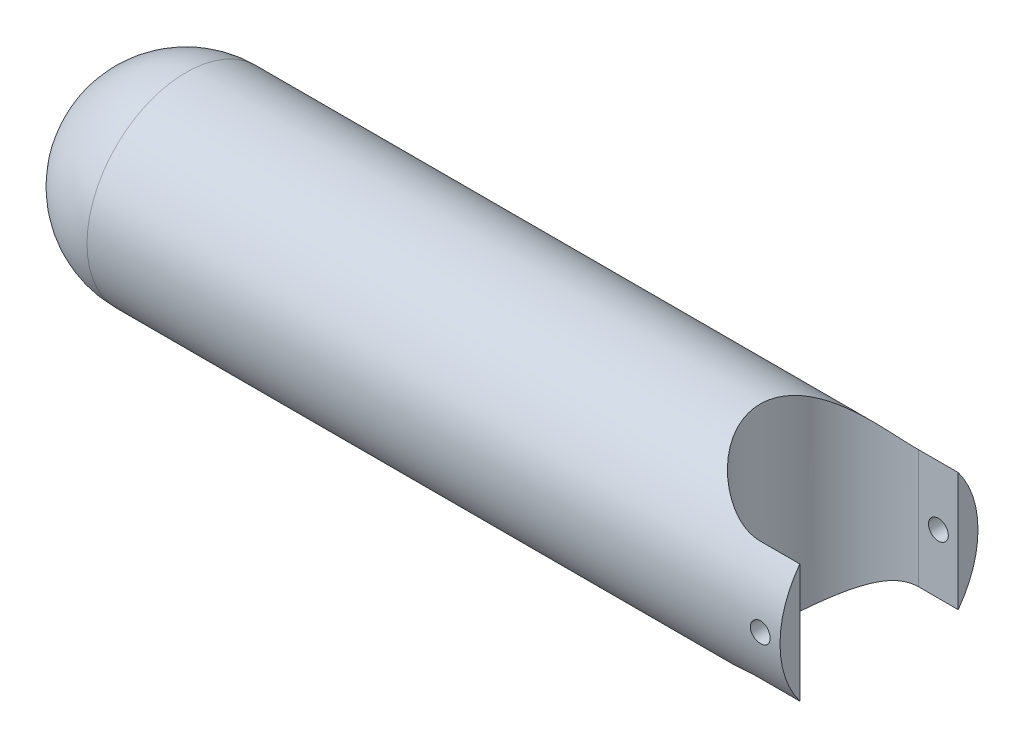
ISO-10303-21;
HEADER;
FILE_DESCRIPTION(('STEP AP214'),'2;1');
FILE_NAME('part.step','',(''),(''),'','','');
FILE_SCHEMA(('AUTOMOTIVE_DESIGN { 1 0 10303 214 1 1 1 1 }'));
ENDSEC;
DATA;
#1=APPLICATION_CONTEXT('core data for automotive mechanical design processes');
#2=APPLICATION_PROTOCOL_DEFINITION('international standard','automotive_design',2000,#1);
#3=PRODUCT_CONTEXT('',#1,'mechanical');
#4=PRODUCT('Part','Part','',(#3));
#5=PRODUCT_RELATED_PRODUCT_CATEGORY('part','',(#4));
#6=PRODUCT_DEFINITION_FORMATION('','',#4);
#7=PRODUCT_DEFINITION_CONTEXT('part definition',#1,'design');
#8=PRODUCT_DEFINITION('design','',#6,#7);
#9=PRODUCT_DEFINITION_SHAPE('','',#8);
#10=(LENGTH_UNIT() NAMED_UNIT(*) SI_UNIT(.MILLI.,.METRE.));
#11=(NAMED_UNIT(*) PLANE_ANGLE_UNIT() SI_UNIT($,.RADIAN.));
#12=(NAMED_UNIT(*) SI_UNIT($,.STERADIAN.) SOLID_ANGLE_UNIT());
#13=UNCERTAINTY_MEASURE_WITH_UNIT(LENGTH_MEASURE(1.E-05),#10,'distance_accuracy_value','');
#14=(GEOMETRIC_REPRESENTATION_CONTEXT(3) GLOBAL_UNCERTAINTY_ASSIGNED_CONTEXT((#13)) GLOBAL_UNIT_ASSIGNED_CONTEXT((#10,
#11,#12)) REPRESENTATION_CONTEXT('',''));
#15=CARTESIAN_POINT('',(0.,0.,0.));
#16=DIRECTION('',(0.,0.,1.));
#17=DIRECTION('',(1.,0.,0.));
#18=AXIS2_PLACEMENT_3D('',#15,#16,#17);
#19=CARTESIAN_POINT('',(-38.0819921267837,0.,0.));
#20=DIRECTION('',(-1.,0.,0.));
#21=DIRECTION('',(0.,0.,1.));
#22=AXIS2_PLACEMENT_3D('',#19,#20,#21);
#23=CYLINDRICAL_SURFACE('',#22,25.);
#24=CARTESIAN_POINT('',(159.418007873216,0.,-25.));
#25=CARTESIAN_POINT('',(159.418001808465,0.140050884478916,-24.9999983880193));
#26=CARTESIAN_POINT('',(159.406199700975,0.280194362919456,-24.9988106399052));
#27=CARTESIAN_POINT('',(159.35929694749,0.556595996242115,-24.9941866898685));
#28=CARTESIAN_POINT('',(159.324170633155,0.692849697922092,-24.9907480108507));
#29=CARTESIAN_POINT('',(159.231652271722,0.957429188633559,-24.9820103640768));
#30=CARTESIAN_POINT('',(159.17427367192,1.0857597115373,-24.9767125200177));
#31=CARTESIAN_POINT('',(159.038905603387,1.33094040240104,-24.9648489348577));
#32=CARTESIAN_POINT('',(158.960920233216,1.44779284694772,-24.9582834459533));
#33=CARTESIAN_POINT('',(158.786251129061,1.66714887668523,-24.9445936085331));
#34=CARTESIAN_POINT('',(158.689508374711,1.76960536208726,-24.9374675393467));
#35=CARTESIAN_POINT('',(158.480196537559,1.95685630357749,-24.9234739226566));
#36=CARTESIAN_POINT('',(158.36762672311,2.04164994270666,-24.9166063871229));
#37=CARTESIAN_POINT('',(158.129561544007,2.19133492610906,-24.9038897888196));
#38=CARTESIAN_POINT('',(158.004039262979,2.25618366363722,-24.8980429177726));
#39=CARTESIAN_POINT('',(157.743818908454,2.36386596185692,-24.8880509386631));
#40=CARTESIAN_POINT('',(157.609121061756,2.40670006647825,-24.8839057885556));
#41=CARTESIAN_POINT('',(157.334853371051,2.46899760400475,-24.8778021018245));
#42=CARTESIAN_POINT('',(157.195301431086,2.48853913250951,-24.8758362599524));
#43=CARTESIAN_POINT('',(156.914885714727,2.50393821283842,-24.8742910765132));
#44=CARTESIAN_POINT('',(156.774021972911,2.49979638717702,-24.8747116722187));
#45=CARTESIAN_POINT('',(156.495519598983,2.46801070063171,-24.8778851724734));
#46=CARTESIAN_POINT('',(156.357871124895,2.44045211031139,-24.8806296147663));
#47=CARTESIAN_POINT('',(156.089162965214,2.36274786037649,-24.8881283571855));
#48=CARTESIAN_POINT('',(155.958103368654,2.31260189563939,-24.8928826844623));
#49=CARTESIAN_POINT('',(155.706023904969,2.1910522347038,-24.9038752363018));
#50=CARTESIAN_POINT('',(155.585022399493,2.11961070679998,-24.910116097704));
#51=CARTESIAN_POINT('',(155.356694835937,1.95752506838309,-24.923376293322));
#52=CARTESIAN_POINT('',(155.249369178262,1.86688039584128,-24.9303956503196));
#53=CARTESIAN_POINT('',(155.050944388244,1.66848528103018,-24.9444596328248));
#54=CARTESIAN_POINT('',(154.959918868514,1.56066119712842,-24.951504233325));
#55=CARTESIAN_POINT('',(154.79724879094,1.3312237043428,-24.964795726963));
#56=CARTESIAN_POINT('',(154.725604254825,1.20961027999902,-24.9710426192064));
#57=CARTESIAN_POINT('',(154.603732822441,0.955995264230925,-24.9820368916774));
#58=CARTESIAN_POINT('',(154.553509661171,0.823991865974772,-24.9867840103693));
#59=CARTESIAN_POINT('',(154.475960581437,0.553368043324846,-24.9942411860352));
#60=CARTESIAN_POINT('',(154.44863397824,0.414747816941518,-24.9969513039266));
#61=CARTESIAN_POINT('',(154.417747103879,0.135462747729778,-25.0000212917078));
#62=CARTESIAN_POINT('',(154.414085252585,-0.00519075526371159,-25.0003912066934));
#63=CARTESIAN_POINT('',(154.430365030838,-0.28510948328923,-24.99876604392));
#64=CARTESIAN_POINT('',(154.450306341505,-0.424374727051154,-24.9967709981117));
#65=CARTESIAN_POINT('',(154.51314211177,-0.697270517086665,-24.9906465384799));
#66=CARTESIAN_POINT('',(154.555989009411,-0.830912122430026,-24.986521547951));
#67=CARTESIAN_POINT('',(154.66337080831,-1.08911080345943,-24.9765999715153));
#68=CARTESIAN_POINT('',(154.727906195815,-1.21366767539277,-24.9708033481314));
#69=CARTESIAN_POINT('',(154.877084969876,-1.45062045043034,-24.9581618832606));
#70=CARTESIAN_POINT('',(154.961795095531,-1.56297414937227,-24.9513135900861));
#71=CARTESIAN_POINT('',(155.148823042569,-1.77190405827967,-24.937348321738));
#72=CARTESIAN_POINT('',(155.251141305892,-1.86847987212292,-24.9302313398243));
#73=CARTESIAN_POINT('',(155.470924309864,-2.04346527471784,-24.9165006035189));
#74=CARTESIAN_POINT('',(155.588442264573,-2.12180819669882,-24.9098887534744));
#75=CARTESIAN_POINT('',(155.835026273583,-2.25764564685953,-24.8979458115223));
#76=CARTESIAN_POINT('',(155.964092169937,-2.31514046013467,-24.892614702101));
#77=CARTESIAN_POINT('',(156.229879721881,-2.40753802171116,-24.8838486908513));
#78=CARTESIAN_POINT('',(156.366587473444,-2.44248043702963,-24.8804104612447));
#79=CARTESIAN_POINT('',(156.643965868118,-2.48891001782363,-24.8758091320719));
#80=CARTESIAN_POINT('',(156.784636397456,-2.50039785599877,-24.8746459672547));
#81=CARTESIAN_POINT('',(157.065284594108,-2.49958284617811,-24.8747278276891));
#82=CARTESIAN_POINT('',(157.205262580423,-2.48738472398275,-24.8759622521753));
#83=CARTESIAN_POINT('',(157.481170166137,-2.4397636324091,-24.8806775972387));
#84=CARTESIAN_POINT('',(157.617099760981,-2.40434063690537,-24.884158520343));
#85=CARTESIAN_POINT('',(157.881051245836,-2.31130421574372,-24.8929717065797));
#86=CARTESIAN_POINT('',(158.009074227291,-2.25369386085225,-24.898303713509));
#87=CARTESIAN_POINT('',(158.253650102394,-2.11792888727758,-24.910218795984));
#88=CARTESIAN_POINT('',(158.370203060268,-2.03977438363851,-24.9168018645238));
#89=CARTESIAN_POINT('',(158.589067059396,-1.86474639071329,-24.9305121802425));
#90=CARTESIAN_POINT('',(158.691315564134,-1.76779487222562,-24.9376416181688));
#91=CARTESIAN_POINT('',(158.878138454965,-1.55807924806273,-24.9516213682196));
#92=CARTESIAN_POINT('',(158.962708601609,-1.44531136027061,-24.9584716130744));
#93=CARTESIAN_POINT('',(159.111941507853,-1.2068535854032,-24.9711390517291));
#94=CARTESIAN_POINT('',(159.176553600579,-1.08113187336689,-24.9769536006703));
#95=CARTESIAN_POINT('',(159.283663930276,-0.820645697751348,-24.9868657312474));
#96=CARTESIAN_POINT('',(159.3261871006,-0.685891624563993,-24.9909652477414));
#97=CARTESIAN_POINT('',(159.377309415928,-0.458645653514227,-24.9959553443434));
#98=CARTESIAN_POINT('',(159.392550483965,-0.367606382111239,-24.9974650172958));
#99=CARTESIAN_POINT('',(159.412901688371,-0.184391452043253,-24.9994878737697));
#100=CARTESIAN_POINT('',(159.418011866521,-0.0922157980663684,-25.0000010614006));
#101=CARTESIAN_POINT('',(159.418007873216,0.,-25.));
#102=B_SPLINE_CURVE_WITH_KNOTS('',3,(#24,#25,#26,#27,#28,#29,#30,#31,#32,#33,#34,#35,#36,#37,
#38,#39,#40,#41,#42,#43,#44,#45,#46,#47,#48,#49,#50,#51,#52,#53,#54,#55,#56,#57,#58,#59,#60,#61,
#62,#63,#64,#65,#66,#67,#68,#69,#70,#71,#72,#73,#74,#75,#76,#77,#78,#79,#80,#81,#82,#83,#84,#85,
#86,#87,#88,#89,#90,#91,#92,#93,#94,#95,#96,#97,#98,#99,#100,#101),.UNSPECIFIED.,.T.,.F.,(4,2,2,
2,2,2,2,2,2,2,2,2,2,2,2,2,2,2,2,2,2,2,2,2,2,2,2,2,2,2,2,2,2,2,2,2,2,2,4),(0.,0.419815915671186,
0.840094607088715,1.2601197143305,1.68006134395697,2.10134642155738,2.52265098051765,
2.94484938680554,3.36703736106259,3.78780580112994,4.20856318139444,4.62779493602774,
5.0470323540408,5.46701903432234,5.88701800827814,6.30886835490517,6.73071917449429,
7.15264351733953,7.57455524188597,7.99465471519393,8.41474851297857,8.8339733823576,
9.25320765123666,9.67384851871745,10.0944999452557,10.5166660902149,10.9388264618843,
11.3602422648251,11.7816459809896,12.2011907323489,12.620735955651,13.04022313407,
13.459707963474,13.8809729356913,14.3023388159239,14.724765775656,15.1467148698824,
15.4231416808087,15.6995673517256),.UNSPECIFIED.);
#103=CARTESIAN_POINT('',(159.418007873216,0.,-25.));
#104=VERTEX_POINT('',#103);
#105=EDGE_CURVE('E114',#104,#104,#102,.T.);
#106=ORIENTED_EDGE('',*,*,#105,.T.);
#107=EDGE_LOOP('',(#106));
#108=FACE_BOUND('',#107,.T.);
#109=CARTESIAN_POINT('',(159.418007873216,0.,25.));
#110=CARTESIAN_POINT('',(159.418001808465,-0.140050884478892,24.9999983880193));
#111=CARTESIAN_POINT('',(159.406199700975,-0.28019436291943,24.9988106399052));
#112=CARTESIAN_POINT('',(159.35929694749,-0.556595996242089,24.9941866898685));
#113=CARTESIAN_POINT('',(159.324170633155,-0.692849697922066,24.9907480108507));
#114=CARTESIAN_POINT('',(159.231652271722,-0.957429188633528,24.9820103640768));
#115=CARTESIAN_POINT('',(159.17427367192,-1.08575971153726,24.9767125200177));
#116=CARTESIAN_POINT('',(159.038905603387,-1.330940402401,24.9648489348577));
#117=CARTESIAN_POINT('',(158.960920233216,-1.44779284694768,24.9582834459533));
#118=CARTESIAN_POINT('',(158.786251129061,-1.66714887668519,24.9445936085331));
#119=CARTESIAN_POINT('',(158.689508374711,-1.76960536208722,24.9374675393467));
#120=CARTESIAN_POINT('',(158.480196537559,-1.95685630357744,24.9234739226566));
#121=CARTESIAN_POINT('',(158.36762672311,-2.04164994270661,24.916606387123));
#122=CARTESIAN_POINT('',(158.129561544007,-2.19133492610902,24.9038897888196));
#123=CARTESIAN_POINT('',(158.004039262979,-2.25618366363718,24.8980429177727));
#124=CARTESIAN_POINT('',(157.743818908454,-2.36386596185688,24.8880509386631));
#125=CARTESIAN_POINT('',(157.609121061756,-2.4067000664782,24.8839057885556));
#126=CARTESIAN_POINT('',(157.334853371051,-2.46899760400471,24.8778021018245));
#127=CARTESIAN_POINT('',(157.195301431086,-2.48853913250946,24.8758362599524));
#128=CARTESIAN_POINT('',(156.914885714727,-2.50393821283837,24.8742910765132));
#129=CARTESIAN_POINT('',(156.774021972911,-2.49979638717697,24.8747116722187));
#130=CARTESIAN_POINT('',(156.495519598983,-2.46801070063166,24.8778851724734));
#131=CARTESIAN_POINT('',(156.357871124895,-2.44045211031135,24.8806296147663));
#132=CARTESIAN_POINT('',(156.089162965214,-2.36274786037644,24.8881283571855));
#133=CARTESIAN_POINT('',(155.958103368654,-2.31260189563934,24.8928826844623));
#134=CARTESIAN_POINT('',(155.706023904969,-2.19105223470374,24.9038752363018));
#135=CARTESIAN_POINT('',(155.585022399493,-2.11961070679992,24.910116097704));
#136=CARTESIAN_POINT('',(155.356694835937,-1.95752506838303,24.923376293322));
#137=CARTESIAN_POINT('',(155.249369178262,-1.86688039584122,24.9303956503196));
#138=CARTESIAN_POINT('',(155.050944388244,-1.66848528103013,24.9444596328248));
#139=CARTESIAN_POINT('',(154.959918868514,-1.56066119712837,24.951504233325));
#140=CARTESIAN_POINT('',(154.79724879094,-1.33122370434274,24.964795726963));
#141=CARTESIAN_POINT('',(154.725604254825,-1.20961027999896,24.9710426192064));
#142=CARTESIAN_POINT('',(154.603732822441,-0.955995264230867,24.9820368916774));
#143=CARTESIAN_POINT('',(154.553509661171,-0.823991865974717,24.9867840103693));
#144=CARTESIAN_POINT('',(154.475960581437,-0.553368043324791,24.9942411860352));
#145=CARTESIAN_POINT('',(154.44863397824,-0.41474781694146,24.9969513039266));
#146=CARTESIAN_POINT('',(154.417747103879,-0.135462747729719,25.0000212917078));
#147=CARTESIAN_POINT('',(154.414085252585,0.00519075526376916,25.0003912066934));
#148=CARTESIAN_POINT('',(154.430365030838,0.285109483289287,24.99876604392));
#149=CARTESIAN_POINT('',(154.450306341505,0.424374727051212,24.9967709981117));
#150=CARTESIAN_POINT('',(154.51314211177,0.697270517086722,24.9906465384799));
#151=CARTESIAN_POINT('',(154.555989009411,0.830912122430082,24.986521547951));
#152=CARTESIAN_POINT('',(154.66337080831,1.08911080345949,24.9765999715153));
#153=CARTESIAN_POINT('',(154.727906195815,1.21366767539283,24.9708033481314));
#154=CARTESIAN_POINT('',(154.877084969876,1.45062045043039,24.9581618832606));
#155=CARTESIAN_POINT('',(154.961795095531,1.56297414937232,24.9513135900861));
#156=CARTESIAN_POINT('',(155.148823042569,1.77190405827972,24.937348321738));
#157=CARTESIAN_POINT('',(155.251141305892,1.86847987212297,24.9302313398243));
#158=CARTESIAN_POINT('',(155.470924309864,2.04346527471788,24.9165006035189));
#159=CARTESIAN_POINT('',(155.588442264573,2.12180819669887,24.9098887534744));
#160=CARTESIAN_POINT('',(155.835026273583,2.25764564685958,24.8979458115223));
#161=CARTESIAN_POINT('',(155.964092169937,2.31514046013472,24.892614702101));
#162=CARTESIAN_POINT('',(156.229879721881,2.40753802171121,24.8838486908513));
#163=CARTESIAN_POINT('',(156.366587473444,2.44248043702968,24.8804104612447));
#164=CARTESIAN_POINT('',(156.643965868118,2.48891001782368,24.8758091320719));
#165=CARTESIAN_POINT('',(156.784636397456,2.50039785599881,24.8746459672547));
#166=CARTESIAN_POINT('',(157.065284594108,2.49958284617816,24.8747278276891));
#167=CARTESIAN_POINT('',(157.205262580423,2.4873847239828,24.8759622521753));
#168=CARTESIAN_POINT('',(157.481170166137,2.43976363240915,24.8806775972387));
#169=CARTESIAN_POINT('',(157.617099760981,2.40434063690541,24.884158520343));
#170=CARTESIAN_POINT('',(157.881051245836,2.31130421574377,24.8929717065797));
#171=CARTESIAN_POINT('',(158.009074227291,2.2536938608523,24.898303713509));
#172=CARTESIAN_POINT('',(158.253650102394,2.11792888727762,24.910218795984));
#173=CARTESIAN_POINT('',(158.370203060268,2.03977438363855,24.9168018645238));
#174=CARTESIAN_POINT('',(158.589067059396,1.86474639071334,24.9305121802425));
#175=CARTESIAN_POINT('',(158.691315564134,1.76779487222567,24.9376416181688));
#176=CARTESIAN_POINT('',(158.878138454965,1.55807924806276,24.9516213682196));
#177=CARTESIAN_POINT('',(158.962708601609,1.44531136027063,24.9584716130744));
#178=CARTESIAN_POINT('',(159.111941507853,1.20685358540321,24.9711390517291));
#179=CARTESIAN_POINT('',(159.176553600579,1.0811318733669,24.9769536006703));
#180=CARTESIAN_POINT('',(159.283663930276,0.820645697751368,24.9868657312474));
#181=CARTESIAN_POINT('',(159.3261871006,0.68589162456402,24.9909652477414));
#182=CARTESIAN_POINT('',(159.377309415928,0.458645653514261,24.9959553443434));
#183=CARTESIAN_POINT('',(159.392550483965,0.367606382111272,24.9974650172958));
#184=CARTESIAN_POINT('',(159.412901688371,0.184391452043282,24.9994878737697));
#185=CARTESIAN_POINT('',(159.418011866521,0.0922157980663939,25.0000010614006));
#186=CARTESIAN_POINT('',(159.418007873216,0.,25.));
#187=B_SPLINE_CURVE_WITH_KNOTS('',3,(#109,#110,#111,#112,#113,#114,#115,#116,#117,#118,#119,
#120,#121,#122,#123,#124,#125,#126,#127,#128,#129,#130,#131,#132,#133,#134,#135,#136,#137,#138,
#139,#140,#141,#142,#143,#144,#145,#146,#147,#148,#149,#150,#151,#152,#153,#154,#155,#156,#157,
#158,#159,#160,#161,#162,#163,#164,#165,#166,#167,#168,#169,#170,#171,#172,#173,#174,#175,#176,
#177,#178,#179,#180,#181,#182,#183,#184,#185,#186),.UNSPECIFIED.,.T.,.F.,(4,2,2,2,2,2,2,2,2,2,2,
2,2,2,2,2,2,2,2,2,2,2,2,2,2,2,2,2,2,2,2,2,2,2,2,2,2,2,4),(0.,0.419815915671183,
0.840094607088709,1.2601197143305,1.68006134395694,2.10134642155735,2.52265098051763,
2.94484938680552,3.36703736106257,3.78780580112991,4.20856318139442,4.62779493602771,
5.04703235404081,5.46701903432235,5.88701800827812,6.30886835490514,6.73071917449428,
7.15264351733952,7.57455524188596,7.99465471519392,8.41474851297856,8.83397338235759,
9.25320765123664,9.67384851871743,10.0944999452557,10.5166660902149,10.9388264618843,
11.3602422648251,11.7816459809896,12.2011907323489,12.6207359556509,13.04022313407,
13.459707963474,13.8809729356913,14.3023388159239,14.724765775656,15.1467148698823,
15.4231416808087,15.6995673517256),.UNSPECIFIED.);
#188=CARTESIAN_POINT('',(159.418007873216,0.,25.));
#189=VERTEX_POINT('',#188);
#190=EDGE_CURVE('E107',#189,#189,#187,.T.);
#191=ORIENTED_EDGE('',*,*,#190,.T.);
#192=EDGE_LOOP('',(#191));
#193=FACE_BOUND('',#192,.T.);
#194=CARTESIAN_POINT('',(-13.0819921267837,0.,0.));
#195=DIRECTION('',(-1.,0.,0.));
#196=DIRECTION('',(0.,0.,1.));
#197=AXIS2_PLACEMENT_3D('',#194,#195,#196);
#198=CIRCLE('',#197,25.);
#199=CARTESIAN_POINT('',(-13.0819921267837,0.,25.));
#200=VERTEX_POINT('',#199);
#201=EDGE_CURVE('E100',#200,#200,#198,.T.);
#202=ORIENTED_EDGE('',*,*,#201,.F.);
#203=EDGE_LOOP('',(#202));
#204=FACE_BOUND('',#203,.T.);
#205=CARTESIAN_POINT('',(161.918007873216,0.,0.));
#206=DIRECTION('',(-1.,0.,0.));
#207=DIRECTION('',(0.,0.,1.));
#208=AXIS2_PLACEMENT_3D('',#205,#206,#207);
#209=CIRCLE('',#208,25.);
#210=CARTESIAN_POINT('',(161.918007873216,-15.0000000000001,20.));
#211=VERTEX_POINT('',#210);
#212=CARTESIAN_POINT('',(161.918007873216,15.0000000000001,20.));
#213=VERTEX_POINT('',#212);
#214=EDGE_CURVE('E91',#211,#213,#209,.T.);
#215=ORIENTED_EDGE('',*,*,#214,.T.);
#216=DIRECTION('',(-1.,0.,0.));
#217=VECTOR('',#216,1.);
#218=CARTESIAN_POINT('',(-38.0819921267837,15.0000000000001,20.));
#219=LINE('',#218,#217);
#220=CARTESIAN_POINT('',(151.918007873216,15.0000000000001,20.));
#221=VERTEX_POINT('',#220);
#222=EDGE_CURVE('E56',#213,#221,#219,.T.);
#223=ORIENTED_EDGE('',*,*,#222,.T.);
#224=CARTESIAN_POINT('',(151.918007873216,15.0000000000001,20.));
#225=CARTESIAN_POINT('',(151.728311463111,14.9999892055047,20.0000031795523));
#226=CARTESIAN_POINT('',(151.538644427596,15.0036002228313,19.9973003704822));
#227=CARTESIAN_POINT('',(151.159756223019,15.0179614976602,19.9865192556902));
#228=CARTESIAN_POINT('',(150.97053500276,15.0287108908347,19.9784416007644));
#229=CARTESIAN_POINT('',(150.40477386559,15.0714568606828,19.9462411914329));
#230=CARTESIAN_POINT('',(150.029408252594,15.1139520327374,19.9141506891152));
#231=CARTESIAN_POINT('',(149.289952608777,15.2241453467618,19.830029390911));
#232=CARTESIAN_POINT('',(148.925779008259,15.2915007135358,19.7782695237896));
#233=CARTESIAN_POINT('',(148.205422797801,15.44861200403,19.655795319828));
#234=CARTESIAN_POINT('',(147.849244235879,15.5383790082031,19.5850716058602));
#235=CARTESIAN_POINT('',(147.020967848938,15.7725000651811,19.3973717004449));
#236=CARTESIAN_POINT('',(146.55284201682,15.9249036828104,19.2728958367173));
#237=CARTESIAN_POINT('',(145.635669021728,16.2568359508472,18.9937428222627));
#238=CARTESIAN_POINT('',(145.186628584387,16.4363740634714,18.8390551306842));
#239=CARTESIAN_POINT('',(144.304959142605,16.816634933881,18.5004332885833));
#240=CARTESIAN_POINT('',(143.872465757669,17.0174961457644,18.3163035021704));
#241=CARTESIAN_POINT('',(143.027018443194,17.4331366613443,17.9211619060056));
#242=CARTESIAN_POINT('',(142.61406449557,17.6479159521575,17.7101501211366));
#243=CARTESIAN_POINT('',(141.662318447755,18.1649899657096,17.181801983051));
#244=CARTESIAN_POINT('',(141.131608100171,18.4710077922352,16.8534999838255));
#245=CARTESIAN_POINT('',(140.105086869111,19.0886687209161,16.1506012827384));
#246=CARTESIAN_POINT('',(139.609288370459,19.400313770536,15.7759882808228));
#247=CARTESIAN_POINT('',(138.654326494455,20.019829379243,14.9819751550326));
#248=CARTESIAN_POINT('',(138.195096403216,20.327705902332,14.5626600133422));
#249=CARTESIAN_POINT('',(137.314255871674,20.9324427082574,13.6791553797477));
#250=CARTESIAN_POINT('',(136.892632949661,21.2293066268945,13.2149808839012));
#251=CARTESIAN_POINT('',(136.169165147835,21.7480055438173,12.338159742977));
#252=CARTESIAN_POINT('',(135.860090961239,21.9730964443943,11.9333881684652));
#253=CARTESIAN_POINT('',(135.270281854358,22.4077449122227,11.0957438274707));
#254=CARTESIAN_POINT('',(134.989545672222,22.6173031710108,10.6628723136515));
#255=CARTESIAN_POINT('',(134.459298463715,23.0168679214114,9.77049326742715));
#256=CARTESIAN_POINT('',(134.209754137239,23.2068952248622,9.31101492073365));
#257=CARTESIAN_POINT('',(133.744496186484,23.5638337608041,8.36662378465812));
#258=CARTESIAN_POINT('',(133.528776946181,23.7307488301091,7.88171523536321));
#259=CARTESIAN_POINT('',(133.166201644182,24.0129023697329,6.96923782436141));
#260=CARTESIAN_POINT('',(133.013850840185,24.1321325183491,6.54508105515029));
#261=CARTESIAN_POINT('',(132.736932845933,24.3496671707053,5.68255563091786));
#262=CARTESIAN_POINT('',(132.612362813109,24.4479738153204,5.24418843518931));
#263=CARTESIAN_POINT('',(132.392747643454,24.6217643701603,4.35585294601409));
#264=CARTESIAN_POINT('',(132.29769050079,24.6972575605558,3.90588945082649));
#265=CARTESIAN_POINT('',(132.138472057695,24.8239341782536,2.99712212151738));
#266=CARTESIAN_POINT('',(132.074311126357,24.8751173151433,2.53831818185429));
#267=CARTESIAN_POINT('',(131.977769054694,24.9521997814249,1.61360588908534));
#268=CARTESIAN_POINT('',(131.945500794936,24.9780093020222,1.14767818669799));
#269=CARTESIAN_POINT('',(131.913698303368,25.0034459520829,0.213986486372684));
#270=CARTESIAN_POINT('',(131.914164134952,25.0030730308413,-0.253777515119696));
#271=CARTESIAN_POINT('',(131.947821546442,24.9761534502702,-1.18737493068696));
#272=CARTESIAN_POINT('',(131.981014040002,24.949606060209,-1.6532082904981));
#273=CARTESIAN_POINT('',(132.079553846397,24.870934407216,-2.57925523963936));
#274=CARTESIAN_POINT('',(132.144900416846,24.8188107347991,-3.03946895846645));
#275=CARTESIAN_POINT('',(132.302241026543,24.6936463903405,-3.92596104738342));
#276=CARTESIAN_POINT('',(132.392583043917,24.6219049567209,-4.35271922238412));
#277=CARTESIAN_POINT('',(132.599795675463,24.45790899453,-5.19567658583721));
#278=CARTESIAN_POINT('',(132.716665098225,24.3656553872153,-5.61187624756569));
#279=CARTESIAN_POINT('',(132.975511691024,24.1621969285397,-6.43169256055114));
#280=CARTESIAN_POINT('',(133.117493332814,24.0509887020438,-6.83530695565781));
#281=CARTESIAN_POINT('',(133.424996327039,23.8113878370565,-7.62819580245175));
#282=CARTESIAN_POINT('',(133.590519078841,23.6829941770294,-8.01746939993845));
#283=CARTESIAN_POINT('',(133.960543137935,23.3977633918279,-8.81713150739057));
#284=CARTESIAN_POINT('',(134.16726353042,23.2393776049929,-9.22593990675977));
#285=CARTESIAN_POINT('',(134.605101284036,22.9066906639188,-10.0234856256012));
#286=CARTESIAN_POINT('',(134.836219938606,22.7323886659711,-10.4122218793496));
#287=CARTESIAN_POINT('',(135.321041405939,22.3703662190132,-11.1688230895831));
#288=CARTESIAN_POINT('',(135.574746561546,22.1826443783938,-11.5366858744185));
#289=CARTESIAN_POINT('',(136.103135101797,21.796277706006,-12.2510086819102));
#290=CARTESIAN_POINT('',(136.377821313383,21.5976314033117,-12.5974658089972));
#291=CARTESIAN_POINT('',(137.005296032061,21.150202597537,-13.3376294157183));
#292=CARTESIAN_POINT('',(137.362534339466,20.899506127778,-13.726414245031));
#293=CARTESIAN_POINT('',(138.103721123349,20.3902419767968,-14.4721087920959));
#294=CARTESIAN_POINT('',(138.487673891868,20.1316730345255,-14.8290133667173));
#295=CARTESIAN_POINT('',(139.281966190305,19.6106965419494,-15.5114556682979));
#296=CARTESIAN_POINT('',(139.692364254684,19.3482815440217,-15.8369195296803));
#297=CARTESIAN_POINT('',(140.538125502946,18.8252807374624,-16.4551714958359));
#298=CARTESIAN_POINT('',(140.973486182328,18.5646947482605,-16.7479628699891));
#299=CARTESIAN_POINT('',(141.826695813804,18.0755165621032,-17.2740328002878));
#300=CARTESIAN_POINT('',(142.242292388825,17.8462332195537,-17.5103218367144));
#301=CARTESIAN_POINT('',(143.094271488242,17.3990461732462,-17.9547353398348));
#302=CARTESIAN_POINT('',(143.530654809856,17.181142906612,-18.1628587251363));
#303=CARTESIAN_POINT('',(144.421726456171,16.764252043147,-18.5483134842753));
#304=CARTESIAN_POINT('',(144.876281604067,16.5651535628435,-18.7258312204124));
#305=CARTESIAN_POINT('',(145.806351094793,16.1917004610108,-19.0496702911967));
#306=CARTESIAN_POINT('',(146.281862376541,16.0173422412446,-19.1959961639638));
#307=CARTESIAN_POINT('',(147.171264264584,15.7284987280342,-19.4330437995642));
#308=CARTESIAN_POINT('',(147.582089986546,15.6088759178309,-19.5289769102654));
#309=CARTESIAN_POINT('',(148.4159055852,15.3981323168235,-19.6955745873314));
#310=CARTESIAN_POINT('',(148.838886383038,15.306990827477,-19.7662575094156));
#311=CARTESIAN_POINT('',(149.483735355282,15.1947284966395,-19.8525175911374));
#312=CARTESIAN_POINT('',(149.702192284889,15.1612168497305,-19.8780989934893));
#313=CARTESIAN_POINT('',(150.141041161548,15.103321978992,-19.9221232358828));
#314=CARTESIAN_POINT('',(150.361433025744,15.0789383662316,-19.9405663800753));
#315=CARTESIAN_POINT('',(150.804149362682,15.0396806971972,-19.9701938970168));
#316=CARTESIAN_POINT('',(151.026477438311,15.0248323845042,-19.9813586205697));
#317=CARTESIAN_POINT('',(151.471868657653,15.0049754758539,-19.9962681219225));
#318=CARTESIAN_POINT('',(151.694931954192,14.9999690742899,-20.0000112449731));
#319=CARTESIAN_POINT('',(151.918007873216,15.0000000000001,-20.));
#320=B_SPLINE_CURVE_WITH_KNOTS('',3,(#224,#225,#226,#227,#228,#229,#230,#231,#232,#233,#234,
#235,#236,#237,#238,#239,#240,#241,#242,#243,#244,#245,#246,#247,#248,#249,#250,#251,#252,#253,
#254,#255,#256,#257,#258,#259,#260,#261,#262,#263,#264,#265,#266,#267,#268,#269,#270,#271,#272,
#273,#274,#275,#276,#277,#278,#279,#280,#281,#282,#283,#284,#285,#286,#287,#288,#289,#290,#291,
#292,#293,#294,#295,#296,#297,#298,#299,#300,#301,#302,#303,#304,#305,#306,#307,#308,#309,#310,
#311,#312,#313,#314,#315,#316,#317,#318,#319),.UNSPECIFIED.,.F.,.F.,(4,2,2,2,2,2,2,2,2,2,2,2,2,
2,2,2,2,2,2,2,2,2,2,2,2,2,2,2,2,2,2,2,2,2,2,2,2,2,2,2,2,2,2,2,2,2,2,4),(0.,0.568978703705476,
1.13788852697589,2.27353227402087,3.39406942668512,4.51516168079343,6.03616420534002,
7.55769835595256,9.08979845444088,10.6218971347711,12.7043398543779,14.7875176280372,
16.8668034547487,18.9453965844892,20.6143184773514,22.2831660225935,23.950216423671,
25.6169897485377,27.0141609092129,28.411189043724,29.8076481208003,31.204123879833,
32.6055247965664,34.0069284272608,35.4083711830722,36.8097815833682,38.1345811758385,
39.4593212800307,40.7842975196406,42.1093525534397,43.5620958152623,45.014916130854,
46.4678873199641,47.9210546258666,49.6728542457993,51.4249359689885,53.1810386579476,
54.9369654642069,56.5264335148794,58.1159625742958,59.6954418739036,61.2746912171958,
62.5886857736988,63.9017231637204,64.5689279220236,65.236104248562,65.9050743404438,
66.5741935717598),.UNSPECIFIED.);
#321=CARTESIAN_POINT('',(151.918007873216,15.0000000000001,-20.));
#322=VERTEX_POINT('',#321);
#323=EDGE_CURVE('E49',#221,#322,#320,.T.);
#324=ORIENTED_EDGE('',*,*,#323,.T.);
#325=DIRECTION('',(-1.,0.,0.));
#326=VECTOR('',#325,1.);
#327=CARTESIAN_POINT('',(-38.0819921267837,15.0000000000001,-20.));
#328=LINE('',#327,#326);
#329=CARTESIAN_POINT('',(161.918007873216,15.0000000000001,-20.));
#330=VERTEX_POINT('',#329);
#331=EDGE_CURVE('E97',#330,#322,#328,.T.);
#332=ORIENTED_EDGE('',*,*,#331,.F.);
#333=CARTESIAN_POINT('',(161.918007873216,-15.0000000000001,-20.));
#334=VERTEX_POINT('',#333);
#335=EDGE_CURVE('E96',#330,#334,#209,.T.);
#336=ORIENTED_EDGE('',*,*,#335,.T.);
#337=DIRECTION('',(-1.,0.,0.));
#338=VECTOR('',#337,1.);
#339=CARTESIAN_POINT('',(-38.0819921267837,-15.0000000000001,-20.));
#340=LINE('',#339,#338);
#341=CARTESIAN_POINT('',(151.918007873216,-15.0000000000001,-20.));
#342=VERTEX_POINT('',#341);
#343=EDGE_CURVE('E101',#342,#334,#340,.F.);
#344=ORIENTED_EDGE('',*,*,#343,.F.);
#345=CARTESIAN_POINT('',(151.918007873216,-15.0000000000001,-20.));
#346=CARTESIAN_POINT('',(151.728311463111,-14.9999892055047,-20.0000031795523));
#347=CARTESIAN_POINT('',(151.538644427596,-15.0036002228313,-19.9973003704822));
#348=CARTESIAN_POINT('',(151.159756223019,-15.0179614976602,-19.9865192556902));
#349=CARTESIAN_POINT('',(150.97053500276,-15.0287108908347,-19.9784416007644));
#350=CARTESIAN_POINT('',(150.40477386559,-15.0714568606828,-19.9462411914329));
#351=CARTESIAN_POINT('',(150.029408252594,-15.1139520327374,-19.9141506891152));
#352=CARTESIAN_POINT('',(149.289952608777,-15.2241453467618,-19.830029390911));
#353=CARTESIAN_POINT('',(148.925779008259,-15.2915007135358,-19.7782695237896));
#354=CARTESIAN_POINT('',(148.205422797801,-15.44861200403,-19.655795319828));
#355=CARTESIAN_POINT('',(147.849244235879,-15.5383790082031,-19.5850716058602));
#356=CARTESIAN_POINT('',(147.020967848938,-15.7725000651811,-19.3973717004449));
#357=CARTESIAN_POINT('',(146.55284201682,-15.9249036828104,-19.2728958367173));
#358=CARTESIAN_POINT('',(145.635669021728,-16.2568359508472,-18.9937428222627));
#359=CARTESIAN_POINT('',(145.186628584387,-16.4363740634714,-18.8390551306842));
#360=CARTESIAN_POINT('',(144.304959142605,-16.816634933881,-18.5004332885833));
#361=CARTESIAN_POINT('',(143.872465757669,-17.0174961457644,-18.3163035021704));
#362=CARTESIAN_POINT('',(143.027018443194,-17.4331366613443,-17.9211619060056));
#363=CARTESIAN_POINT('',(142.61406449557,-17.6479159521575,-17.7101501211366));
#364=CARTESIAN_POINT('',(141.662318447755,-18.1649899657096,-17.181801983051));
#365=CARTESIAN_POINT('',(141.131608100171,-18.4710077922352,-16.8534999838255));
#366=CARTESIAN_POINT('',(140.105086869111,-19.0886687209161,-16.1506012827384));
#367=CARTESIAN_POINT('',(139.609288370459,-19.400313770536,-15.7759882808228));
#368=CARTESIAN_POINT('',(138.654326494455,-20.019829379243,-14.9819751550326));
#369=CARTESIAN_POINT('',(138.195096403216,-20.327705902332,-14.5626600133422));
#370=CARTESIAN_POINT('',(137.314255871674,-20.9324427082574,-13.6791553797477));
#371=CARTESIAN_POINT('',(136.892632949661,-21.2293066268945,-13.2149808839012));
#372=CARTESIAN_POINT('',(136.169165147835,-21.7480055438173,-12.338159742977));
#373=CARTESIAN_POINT('',(135.860090961239,-21.9730964443943,-11.9333881684652));
#374=CARTESIAN_POINT('',(135.270281854358,-22.4077449122227,-11.0957438274707));
#375=CARTESIAN_POINT('',(134.989545672222,-22.6173031710108,-10.6628723136515));
#376=CARTESIAN_POINT('',(134.459298463715,-23.0168679214114,-9.77049326742715));
#377=CARTESIAN_POINT('',(134.209754137239,-23.2068952248622,-9.31101492073365));
#378=CARTESIAN_POINT('',(133.744496186484,-23.5638337608041,-8.36662378465812));
#379=CARTESIAN_POINT('',(133.528776946181,-23.7307488301091,-7.88171523536321));
#380=CARTESIAN_POINT('',(133.166201644182,-24.0129023697329,-6.96923782436141));
#381=CARTESIAN_POINT('',(133.013850840185,-24.1321325183491,-6.54508105515029));
#382=CARTESIAN_POINT('',(132.736932845933,-24.3496671707053,-5.68255563091786));
#383=CARTESIAN_POINT('',(132.612362813109,-24.4479738153204,-5.24418843518931));
#384=CARTESIAN_POINT('',(132.392747643454,-24.6217643701603,-4.35585294601409));
#385=CARTESIAN_POINT('',(132.29769050079,-24.6972575605558,-3.90588945082649));
#386=CARTESIAN_POINT('',(132.138472057695,-24.8239341782536,-2.99712212151738));
#387=CARTESIAN_POINT('',(132.074311126357,-24.8751173151433,-2.53831818185429));
#388=CARTESIAN_POINT('',(131.977769054694,-24.9521997814249,-1.61360588908534));
#389=CARTESIAN_POINT('',(131.945500794936,-24.9780093020222,-1.14767818669799));
#390=CARTESIAN_POINT('',(131.913698303368,-25.0034459520829,-0.213986486372684));
#391=CARTESIAN_POINT('',(131.914164134952,-25.0030730308413,0.253777515119696));
#392=CARTESIAN_POINT('',(131.947821546442,-24.9761534502702,1.18737493068696));
#393=CARTESIAN_POINT('',(131.981014040002,-24.949606060209,1.6532082904981));
#394=CARTESIAN_POINT('',(132.079553846397,-24.870934407216,2.57925523963936));
#395=CARTESIAN_POINT('',(132.144900416846,-24.8188107347991,3.03946895846645));
#396=CARTESIAN_POINT('',(132.302241026543,-24.6936463903405,3.92596104738342));
#397=CARTESIAN_POINT('',(132.392583043917,-24.6219049567209,4.35271922238412));
#398=CARTESIAN_POINT('',(132.599795675463,-24.45790899453,5.19567658583721));
#399=CARTESIAN_POINT('',(132.716665098225,-24.3656553872153,5.61187624756569));
#400=CARTESIAN_POINT('',(132.975511691024,-24.1621969285397,6.43169256055114));
#401=CARTESIAN_POINT('',(133.117493332814,-24.0509887020438,6.83530695565781));
#402=CARTESIAN_POINT('',(133.424996327039,-23.8113878370565,7.62819580245175));
#403=CARTESIAN_POINT('',(133.590519078841,-23.6829941770294,8.01746939993845));
#404=CARTESIAN_POINT('',(133.960543137935,-23.3977633918279,8.81713150739057));
#405=CARTESIAN_POINT('',(134.16726353042,-23.2393776049929,9.22593990675977));
#406=CARTESIAN_POINT('',(134.605101284036,-22.9066906639188,10.0234856256012));
#407=CARTESIAN_POINT('',(134.836219938606,-22.7323886659711,10.4122218793496));
#408=CARTESIAN_POINT('',(135.321041405939,-22.3703662190132,11.1688230895831));
#409=CARTESIAN_POINT('',(135.574746561546,-22.1826443783938,11.5366858744185));
#410=CARTESIAN_POINT('',(136.103135101797,-21.796277706006,12.2510086819102));
#411=CARTESIAN_POINT('',(136.377821313383,-21.5976314033117,12.5974658089972));
#412=CARTESIAN_POINT('',(137.005296032061,-21.150202597537,13.3376294157183));
#413=CARTESIAN_POINT('',(137.362534339466,-20.899506127778,13.726414245031));
#414=CARTESIAN_POINT('',(138.103721123349,-20.3902419767968,14.4721087920959));
#415=CARTESIAN_POINT('',(138.487673891868,-20.1316730345255,14.8290133667173));
#416=CARTESIAN_POINT('',(139.281966190305,-19.6106965419494,15.5114556682979));
#417=CARTESIAN_POINT('',(139.692364254684,-19.3482815440217,15.8369195296803));
#418=CARTESIAN_POINT('',(140.538125502946,-18.8252807374624,16.4551714958359));
#419=CARTESIAN_POINT('',(140.973486182328,-18.5646947482605,16.7479628699891));
#420=CARTESIAN_POINT('',(141.826695813804,-18.0755165621032,17.2740328002878));
#421=CARTESIAN_POINT('',(142.242292388825,-17.8462332195537,17.5103218367144));
#422=CARTESIAN_POINT('',(143.094271488242,-17.3990461732462,17.9547353398348));
#423=CARTESIAN_POINT('',(143.530654809856,-17.181142906612,18.1628587251363));
#424=CARTESIAN_POINT('',(144.421726456171,-16.764252043147,18.5483134842753));
#425=CARTESIAN_POINT('',(144.876281604067,-16.5651535628435,18.7258312204124));
#426=CARTESIAN_POINT('',(145.806351094793,-16.1917004610108,19.0496702911967));
#427=CARTESIAN_POINT('',(146.281862376541,-16.0173422412446,19.1959961639638));
#428=CARTESIAN_POINT('',(147.171264264584,-15.7284987280342,19.4330437995642));
#429=CARTESIAN_POINT('',(147.582089986546,-15.6088759178309,19.5289769102654));
#430=CARTESIAN_POINT('',(148.4159055852,-15.3981323168235,19.6955745873314));
#431=CARTESIAN_POINT('',(148.838886383038,-15.306990827477,19.7662575094156));
#432=CARTESIAN_POINT('',(149.483735355282,-15.1947284966395,19.8525175911374));
#433=CARTESIAN_POINT('',(149.702192284889,-15.1612168497305,19.8780989934893));
#434=CARTESIAN_POINT('',(150.141041161548,-15.103321978992,19.9221232358828));
#435=CARTESIAN_POINT('',(150.361433025744,-15.0789383662316,19.9405663800753));
#436=CARTESIAN_POINT('',(150.804149362682,-15.0396806971972,19.9701938970168));
#437=CARTESIAN_POINT('',(151.026477438311,-15.0248323845042,19.9813586205697));
#438=CARTESIAN_POINT('',(151.471868657653,-15.0049754758539,19.9962681219225));
#439=CARTESIAN_POINT('',(151.694931954192,-14.9999690742899,20.0000112449731));
#440=CARTESIAN_POINT('',(151.918007873216,-15.0000000000001,20.));
#441=B_SPLINE_CURVE_WITH_KNOTS('',3,(#345,#346,#347,#348,#349,#350,#351,#352,#353,#354,#355,
#356,#357,#358,#359,#360,#361,#362,#363,#364,#365,#366,#367,#368,#369,#370,#371,#372,#373,#374,
#375,#376,#377,#378,#379,#380,#381,#382,#383,#384,#385,#386,#387,#388,#389,#390,#391,#392,#393,
#394,#395,#396,#397,#398,#399,#400,#401,#402,#403,#404,#405,#406,#407,#408,#409,#410,#411,#412,
#413,#414,#415,#416,#417,#418,#419,#420,#421,#422,#423,#424,#425,#426,#427,#428,#429,#430,#431,
#432,#433,#434,#435,#436,#437,#438,#439,#440),.UNSPECIFIED.,.F.,.F.,(4,2,2,2,2,2,2,2,2,2,2,2,2,
2,2,2,2,2,2,2,2,2,2,2,2,2,2,2,2,2,2,2,2,2,2,2,2,2,2,2,2,2,2,2,2,2,2,4),(0.,0.568978703705476,
1.13788852697589,2.27353227402087,3.39406942668512,4.51516168079343,6.03616420534002,
7.55769835595256,9.08979845444088,10.6218971347711,12.7043398543779,14.7875176280372,
16.8668034547487,18.9453965844892,20.6143184773514,22.2831660225935,23.950216423671,
25.6169897485377,27.0141609092129,28.411189043724,29.8076481208003,31.204123879833,
32.6055247965664,34.0069284272608,35.4083711830722,36.8097815833682,38.1345811758385,
39.4593212800307,40.7842975196406,42.1093525534397,43.5620958152623,45.014916130854,
46.4678873199641,47.9210546258666,49.6728542457993,51.4249359689885,53.1810386579476,
54.9369654642069,56.5264335148794,58.1159625742958,59.6954418739036,61.2746912171958,
62.5886857736988,63.9017231637204,64.5689279220236,65.236104248562,65.9050743404438,
66.5741935717598),.UNSPECIFIED.);
#442=CARTESIAN_POINT('',(151.918007873216,-15.0000000000001,20.));
#443=VERTEX_POINT('',#442);
#444=EDGE_CURVE('E11',#342,#443,#441,.T.);
#445=ORIENTED_EDGE('',*,*,#444,.T.);
#446=DIRECTION('',(-1.,0.,0.));
#447=VECTOR('',#446,1.);
#448=CARTESIAN_POINT('',(-38.0819921267837,-15.0000000000001,20.));
#449=LINE('',#448,#447);
#450=EDGE_CURVE('E83',#443,#211,#449,.F.);
#451=ORIENTED_EDGE('',*,*,#450,.T.);
#452=EDGE_LOOP('',(#215,#223,#324,#332,#336,#344,#445,#451));
#453=FACE_BOUND('',#452,.T.);
#454=ADVANCED_FACE('F36',(#108,#193,#204,#453),#23,.T.);
#455=CARTESIAN_POINT('',(161.918007873216,0.,0.));
#456=DIRECTION('',(-1.,0.,0.));
#457=DIRECTION('',(0.,0.,1.));
#458=AXIS2_PLACEMENT_3D('',#455,#456,#457);
#459=PLANE('',#458);
#460=DIRECTION('',(0.,1.,0.));
#461=VECTOR('',#460,1.);
#462=CARTESIAN_POINT('',(161.918007873216,-25.,-20.));
#463=LINE('',#462,#461);
#464=EDGE_CURVE('E64',#334,#330,#463,.T.);
#465=ORIENTED_EDGE('',*,*,#464,.F.);
#466=ORIENTED_EDGE('',*,*,#335,.F.);
#467=EDGE_LOOP('',(#465,#466));
#468=FACE_BOUND('',#467,.T.);
#469=ADVANCED_FACE('F132',(#468),#459,.F.);
#470=CARTESIAN_POINT('',(156.918007873216,0.,-25.));
#471=DIRECTION('',(0.,0.,1.));
#472=DIRECTION('',(1.,0.,0.));
#473=AXIS2_PLACEMENT_3D('',#470,#471,#472);
#474=CYLINDRICAL_SURFACE('',#473,2.5);
#475=ORIENTED_EDGE('',*,*,#105,.F.);
#476=EDGE_LOOP('',(#475));
#477=FACE_BOUND('',#476,.T.);
#478=CARTESIAN_POINT('',(156.918007873216,0.,-20.));
#479=DIRECTION('',(0.,0.,1.));
#480=DIRECTION('',(1.,0.,0.));
#481=AXIS2_PLACEMENT_3D('',#478,#479,#480);
#482=CIRCLE('',#481,2.5);
#483=CARTESIAN_POINT('',(159.418007873216,0.,-20.));
#484=VERTEX_POINT('',#483);
#485=EDGE_CURVE('E157',#484,#484,#482,.F.);
#486=ORIENTED_EDGE('',*,*,#485,.F.);
#487=EDGE_LOOP('',(#486));
#488=FACE_BOUND('',#487,.T.);
#489=ADVANCED_FACE('F127',(#477,#488),#474,.F.);
#490=CARTESIAN_POINT('',(-13.0819921267837,0.,0.));
#491=DIRECTION('',(-1.,0.,0.));
#492=DIRECTION('',(0.,0.,-1.));
#493=AXIS2_PLACEMENT_3D('',#490,#491,#492);
#494=SPHERICAL_SURFACE('',#493,25.);
#495=ORIENTED_EDGE('',*,*,#201,.T.);
#496=EDGE_LOOP('',(#495));
#497=FACE_BOUND('',#496,.T.);
#498=ADVANCED_FACE('F38',(#497),#494,.T.);
#499=ORIENTED_EDGE('',*,*,#214,.F.);
#500=DIRECTION('',(0.,1.,0.));
#501=VECTOR('',#500,1.);
#502=CARTESIAN_POINT('',(161.918007873216,-25.,20.));
#503=LINE('',#502,#501);
#504=EDGE_CURVE('E80',#211,#213,#503,.T.);
#505=ORIENTED_EDGE('',*,*,#504,.T.);
#506=EDGE_LOOP('',(#499,#505));
#507=FACE_BOUND('',#506,.T.);
#508=ADVANCED_FACE('F95',(#507),#459,.F.);
#509=CARTESIAN_POINT('',(156.918007873216,0.,20.));
#510=DIRECTION('',(0.,0.,1.));
#511=DIRECTION('',(1.,0.,0.));
#512=AXIS2_PLACEMENT_3D('',#509,#510,#511);
#513=CIRCLE('',#512,2.5);
#514=CARTESIAN_POINT('',(159.418007873216,0.,20.));
#515=VERTEX_POINT('',#514);
#516=EDGE_CURVE('E93',#515,#515,#513,.F.);
#517=ORIENTED_EDGE('',*,*,#516,.T.);
#518=EDGE_LOOP('',(#517));
#519=FACE_BOUND('',#518,.T.);
#520=ORIENTED_EDGE('',*,*,#190,.F.);
#521=EDGE_LOOP('',(#520));
#522=FACE_BOUND('',#521,.T.);
#523=ADVANCED_FACE('F121',(#519,#522),#474,.F.);
#524=CARTESIAN_POINT('',(151.918007873216,-25.,0.));
#525=DIRECTION('',(0.,1.,0.));
#526=DIRECTION('',(0.,0.,1.));
#527=AXIS2_PLACEMENT_3D('',#524,#525,#526);
#528=CYLINDRICAL_SURFACE('',#527,20.);
#529=DIRECTION('',(0.,1.,0.));
#530=VECTOR('',#529,1.);
#531=CARTESIAN_POINT('',(151.918007873216,-25.,20.));
#532=LINE('',#531,#530);
#533=EDGE_CURVE('E88',#443,#221,#532,.T.);
#534=ORIENTED_EDGE('',*,*,#533,.F.);
#535=ORIENTED_EDGE('',*,*,#444,.F.);
#536=DIRECTION('',(0.,1.,0.));
#537=VECTOR('',#536,1.);
#538=CARTESIAN_POINT('',(151.918007873216,-25.,-20.));
#539=LINE('',#538,#537);
#540=EDGE_CURVE('E241',#342,#322,#539,.T.);
#541=ORIENTED_EDGE('',*,*,#540,.T.);
#542=ORIENTED_EDGE('',*,*,#323,.F.);
#543=EDGE_LOOP('',(#534,#535,#541,#542));
#544=FACE_BOUND('',#543,.T.);
#545=ADVANCED_FACE('F125',(#544),#528,.F.);
#546=CARTESIAN_POINT('',(151.918007873216,-25.,-20.));
#547=DIRECTION('',(0.,0.,1.));
#548=DIRECTION('',(1.,0.,0.));
#549=AXIS2_PLACEMENT_3D('',#546,#547,#548);
#550=PLANE('',#549);
#551=ORIENTED_EDGE('',*,*,#485,.T.);
#552=EDGE_LOOP('',(#551));
#553=FACE_BOUND('',#552,.T.);
#554=ORIENTED_EDGE('',*,*,#331,.T.);
#555=ORIENTED_EDGE('',*,*,#540,.F.);
#556=ORIENTED_EDGE('',*,*,#343,.T.);
#557=ORIENTED_EDGE('',*,*,#464,.T.);
#558=EDGE_LOOP('',(#554,#555,#556,#557));
#559=FACE_BOUND('',#558,.T.);
#560=ADVANCED_FACE('F128',(#553,#559),#550,.T.);
#561=CARTESIAN_POINT('',(151.918007873216,-25.,20.));
#562=DIRECTION('',(0.,0.,1.));
#563=DIRECTION('',(1.,0.,0.));
#564=AXIS2_PLACEMENT_3D('',#561,#562,#563);
#565=PLANE('',#564);
#566=ORIENTED_EDGE('',*,*,#516,.F.);
#567=EDGE_LOOP('',(#566));
#568=FACE_BOUND('',#567,.T.);
#569=ORIENTED_EDGE('',*,*,#504,.F.);
#570=ORIENTED_EDGE('',*,*,#450,.F.);
#571=ORIENTED_EDGE('',*,*,#533,.T.);
#572=ORIENTED_EDGE('',*,*,#222,.F.);
#573=EDGE_LOOP('',(#569,#570,#571,#572));
#574=FACE_BOUND('',#573,.T.);
#575=ADVANCED_FACE('F82',(#568,#574),#565,.F.);
#576=CLOSED_SHELL('',(#454,#469,#489,#498,#508,#523,#545,#560,#575));
#577=MANIFOLD_SOLID_BREP('B2',#576);
#578=ADVANCED_BREP_SHAPE_REPRESENTATION('',(#18,#577),#14);
#579=SHAPE_DEFINITION_REPRESENTATION(#9,#578);
ENDSEC;
END-ISO-10303-21;
